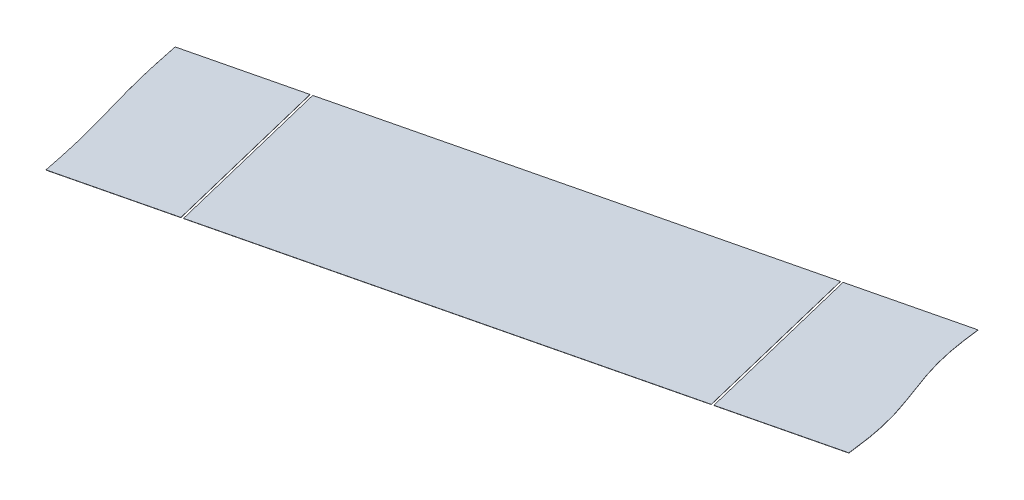
ISO-10303-21;
HEADER;
FILE_DESCRIPTION(('STEP AP214'),'2;1');
FILE_NAME('part.step','',(''),(''),'','','');
FILE_SCHEMA(('AUTOMOTIVE_DESIGN { 1 0 10303 214 1 1 1 1 }'));
ENDSEC;
DATA;
#1=APPLICATION_CONTEXT('core data for automotive mechanical design processes');
#2=APPLICATION_PROTOCOL_DEFINITION('international standard','automotive_design',2000,#1);
#3=PRODUCT_CONTEXT('',#1,'mechanical');
#4=PRODUCT('Part','Part','',(#3));
#5=PRODUCT_RELATED_PRODUCT_CATEGORY('part','',(#4));
#6=PRODUCT_DEFINITION_FORMATION('','',#4);
#7=PRODUCT_DEFINITION_CONTEXT('part definition',#1,'design');
#8=PRODUCT_DEFINITION('design','',#6,#7);
#9=PRODUCT_DEFINITION_SHAPE('','',#8);
#10=(LENGTH_UNIT() NAMED_UNIT(*) SI_UNIT(.MILLI.,.METRE.));
#11=(NAMED_UNIT(*) PLANE_ANGLE_UNIT() SI_UNIT($,.RADIAN.));
#12=(NAMED_UNIT(*) SI_UNIT($,.STERADIAN.) SOLID_ANGLE_UNIT());
#13=UNCERTAINTY_MEASURE_WITH_UNIT(LENGTH_MEASURE(1.E-05),#10,'distance_accuracy_value','');
#14=(GEOMETRIC_REPRESENTATION_CONTEXT(3) GLOBAL_UNCERTAINTY_ASSIGNED_CONTEXT((#13)) GLOBAL_UNIT_ASSIGNED_CONTEXT((#10,
#11,#12)) REPRESENTATION_CONTEXT('',''));
#15=CARTESIAN_POINT('',(0.,0.,0.));
#16=DIRECTION('',(0.,0.,1.));
#17=DIRECTION('',(1.,0.,0.));
#18=AXIS2_PLACEMENT_3D('',#15,#16,#17);
#19=CARTESIAN_POINT('',(2395.27818483003,381.38489247794,252.447974601586));
#20=DIRECTION('',(0.235073047336167,-0.00396825396826431,0.971969606199974));
#21=DIRECTION('',(0.971977259112275,0.,-0.235074898210314));
#22=AXIS2_PLACEMENT_3D('',#19,#20,#21);
#23=PLANE('',#22);
#24=DIRECTION('',(0.000932836897662165,0.999992126449225,0.00385705261553395));
#25=VECTOR('',#24,1.);
#26=CARTESIAN_POINT('',(2345.08494572677,371.384971213448,264.546496375752));
#27=LINE('',#26,#25);
#28=CARTESIAN_POINT('',(2345.09418081205,381.284893265295,264.584681196645));
#29=VERTEX_POINT('',#28);
#30=CARTESIAN_POINT('',(2345.09427409574,381.38489247794,264.585066901907));
#31=VERTEX_POINT('',#30);
#32=EDGE_CURVE('E122',#29,#31,#27,.T.);
#33=ORIENTED_EDGE('',*,*,#32,.T.);
#34=DIRECTION('',(-0.971977259112275,0.,0.235074898210314));
#35=VECTOR('',#34,1.);
#36=CARTESIAN_POINT('',(2395.27818483003,381.38489247794,252.447974601586));
#37=LINE('',#36,#35);
#38=CARTESIAN_POINT('',(2152.64277679151,381.38489247794,311.129896747549));
#39=VERTEX_POINT('',#38);
#40=EDGE_CURVE('E58',#31,#39,#37,.T.);
#41=ORIENTED_EDGE('',*,*,#40,.T.);
#42=DIRECTION('',(0.000932836897662165,0.999992126449225,0.00385705261553395));
#43=VECTOR('',#42,1.);
#44=CARTESIAN_POINT('',(2152.63344842254,371.384971213448,311.091326221394));
#45=LINE('',#44,#43);
#46=CARTESIAN_POINT('',(2152.64268350782,381.284893265295,311.129511042288));
#47=VERTEX_POINT('',#46);
#48=EDGE_CURVE('E117',#47,#39,#45,.T.);
#49=ORIENTED_EDGE('',*,*,#48,.F.);
#50=DIRECTION('',(-0.971977259112275,0.,0.235074898210314));
#51=VECTOR('',#50,1.);
#52=CARTESIAN_POINT('',(2395.27809154634,381.284893265295,252.447588896325));
#53=LINE('',#52,#51);
#54=EDGE_CURVE('E87',#29,#47,#53,.T.);
#55=ORIENTED_EDGE('',*,*,#54,.F.);
#56=EDGE_LOOP('',(#33,#41,#49,#55));
#57=FACE_BOUND('',#56,.T.);
#58=ADVANCED_FACE('F55',(#57),#23,.T.);
#59=CARTESIAN_POINT('',(2376.60605366932,381.699900005905,175.293985663563));
#60=DIRECTION('',(0.235073047336167,-0.00396825396826431,0.971969606199973));
#61=DIRECTION('',(0.971977259112275,0.,-0.235074898210314));
#62=AXIS2_PLACEMENT_3D('',#59,#60,#61);
#63=PLANE('',#62);
#64=DIRECTION('',(-0.971977259112275,0.,0.235074898210314));
#65=VECTOR('',#64,1.);
#66=CARTESIAN_POINT('',(2376.60605366932,381.699900005905,175.293985663563));
#67=LINE('',#66,#65);
#68=CARTESIAN_POINT('',(2326.4337296536,381.699900005905,187.428275689794));
#69=VERTEX_POINT('',#68);
#70=CARTESIAN_POINT('',(2133.98223234937,381.699900005905,233.973105535437));
#71=VERTEX_POINT('',#70);
#72=EDGE_CURVE('E114',#69,#71,#67,.T.);
#73=ORIENTED_EDGE('',*,*,#72,.F.);
#74=DIRECTION('',(0.000932836897662165,0.999992126449225,0.00385705261553395));
#75=VECTOR('',#74,1.);
#76=CARTESIAN_POINT('',(2326.42440128462,371.699978741413,187.389705163639));
#77=LINE('',#76,#75);
#78=CARTESIAN_POINT('',(2326.43363636991,381.59990079326,187.427889984532));
#79=VERTEX_POINT('',#78);
#80=EDGE_CURVE('E64',#79,#69,#77,.T.);
#81=ORIENTED_EDGE('',*,*,#80,.F.);
#82=DIRECTION('',(-0.971977259112275,0.,0.235074898210314));
#83=VECTOR('',#82,1.);
#84=CARTESIAN_POINT('',(2376.60596038563,381.59990079326,175.293599958301));
#85=LINE('',#84,#83);
#86=CARTESIAN_POINT('',(2133.98213906568,381.59990079326,233.972719830176));
#87=VERTEX_POINT('',#86);
#88=EDGE_CURVE('E103',#79,#87,#85,.T.);
#89=ORIENTED_EDGE('',*,*,#88,.T.);
#90=DIRECTION('',(0.000932836897662165,0.999992126449225,0.00385705261553395));
#91=VECTOR('',#90,1.);
#92=CARTESIAN_POINT('',(2133.97290398039,371.699978741413,233.934535009282));
#93=LINE('',#92,#91);
#94=EDGE_CURVE('E107',#87,#71,#93,.T.);
#95=ORIENTED_EDGE('',*,*,#94,.T.);
#96=EDGE_LOOP('',(#73,#81,#89,#95));
#97=FACE_BOUND('',#96,.T.);
#98=ADVANCED_FACE('F106',(#97),#63,.F.);
#99=CARTESIAN_POINT('',(4596.43898357471,393.653775003779,-3460.77851322098));
#100=DIRECTION('',(0.000932836897662165,0.999992126449225,0.00385705261553395));
#101=DIRECTION('',(0.,-0.00385705429370909,0.999992561538422));
#102=AXIS2_PLACEMENT_3D('',#99,#100,#101);
#103=PLANE('',#102);
#104=DIRECTION('',(0.235073047336166,-0.0039682539682627,0.971969606199974));
#105=VECTOR('',#104,1.);
#106=CARTESIAN_POINT('',(2345.09427409574,381.38489247794,264.585066901907));
#107=LINE('',#106,#105);
#108=EDGE_CURVE('E14',#69,#31,#107,.T.);
#109=ORIENTED_EDGE('',*,*,#108,.F.);
#110=ORIENTED_EDGE('',*,*,#72,.T.);
#111=DIRECTION('',(-0.235073047336166,0.0039682539682634,-0.971969606199974));
#112=VECTOR('',#111,1.);
#113=CARTESIAN_POINT('',(2152.64277679151,381.38489247794,311.129896747549));
#114=LINE('',#113,#112);
#115=EDGE_CURVE('E113',#39,#71,#114,.T.);
#116=ORIENTED_EDGE('',*,*,#115,.F.);
#117=ORIENTED_EDGE('',*,*,#40,.F.);
#118=EDGE_LOOP('',(#109,#110,#116,#117));
#119=FACE_BOUND('',#118,.T.);
#120=ADVANCED_FACE('F128',(#119),#103,.T.);
#121=CARTESIAN_POINT('',(4596.43889029102,393.553775791134,-3460.77889892624));
#122=DIRECTION('',(0.000932836897662165,0.999992126449225,0.00385705261553395));
#123=DIRECTION('',(0.,-0.00385705429370909,0.999992561538422));
#124=AXIS2_PLACEMENT_3D('',#121,#122,#123);
#125=PLANE('',#124);
#126=ORIENTED_EDGE('',*,*,#88,.F.);
#127=DIRECTION('',(0.235073047336166,-0.00396825396826328,0.971969606199974));
#128=VECTOR('',#127,1.);
#129=CARTESIAN_POINT('',(1618.30511291864,393.553775791134,-2740.51050991896));
#130=LINE('',#129,#128);
#131=EDGE_CURVE('E73',#79,#29,#130,.T.);
#132=ORIENTED_EDGE('',*,*,#131,.T.);
#133=ORIENTED_EDGE('',*,*,#54,.T.);
#134=DIRECTION('',(-0.235073047336166,0.00396825396826328,-0.971969606199974));
#135=VECTOR('',#134,1.);
#136=CARTESIAN_POINT('',(1425.85361561441,393.553775791134,-2693.96568007332));
#137=LINE('',#136,#135);
#138=EDGE_CURVE('E111',#47,#87,#137,.T.);
#139=ORIENTED_EDGE('',*,*,#138,.T.);
#140=EDGE_LOOP('',(#126,#132,#133,#139));
#141=FACE_BOUND('',#140,.T.);
#142=ADVANCED_FACE('F116',(#141),#125,.F.);
#143=CARTESIAN_POINT('',(2152.63344842254,371.384971213448,311.091326221394));
#144=DIRECTION('',(0.971977259112275,0.,-0.235074898210313));
#145=DIRECTION('',(-0.235074898210313,0.,-0.971977259112275));
#146=AXIS2_PLACEMENT_3D('',#143,#144,#145);
#147=PLANE('',#146);
#148=ORIENTED_EDGE('',*,*,#48,.T.);
#149=ORIENTED_EDGE('',*,*,#115,.T.);
#150=ORIENTED_EDGE('',*,*,#94,.F.);
#151=ORIENTED_EDGE('',*,*,#138,.F.);
#152=EDGE_LOOP('',(#148,#149,#150,#151));
#153=FACE_BOUND('',#152,.T.);
#154=ADVANCED_FACE('F110',(#153),#147,.F.);
#155=CARTESIAN_POINT('',(2345.08494572677,371.384971213448,264.546496375752));
#156=DIRECTION('',(-0.971977259112275,0.,0.235074898210313));
#157=DIRECTION('',(0.235074898210313,0.,0.971977259112275));
#158=AXIS2_PLACEMENT_3D('',#155,#156,#157);
#159=PLANE('',#158);
#160=ORIENTED_EDGE('',*,*,#80,.T.);
#161=ORIENTED_EDGE('',*,*,#108,.T.);
#162=ORIENTED_EDGE('',*,*,#32,.F.);
#163=ORIENTED_EDGE('',*,*,#131,.F.);
#164=EDGE_LOOP('',(#160,#161,#162,#163));
#165=FACE_BOUND('',#164,.T.);
#166=ADVANCED_FACE('F129',(#165),#159,.F.);
#167=CLOSED_SHELL('',(#58,#98,#120,#142,#154,#166));
#168=MANIFOLD_SOLID_BREP('B2',#167);
#169=CARTESIAN_POINT('',(2395.27818483003,381.38489247794,252.447974601588));
#170=CARTESIAN_POINT('',(2395.23043806307,381.386475828937,252.049017486661));
#171=CARTESIAN_POINT('',(2395.20393658994,381.387353474253,251.82788572132));
#172=CARTESIAN_POINT('',(2395.1628766104,381.388713251445,251.485275870303));
#173=CARTESIAN_POINT('',(2395.04691486838,381.392539552048,250.521302221176));
#174=CARTESIAN_POINT('',(2394.97939194031,381.394736463189,249.968054397501));
#175=CARTESIAN_POINT('',(2394.89889819591,381.397355389959,249.308530437594));
#176=CARTESIAN_POINT('',(2394.74563612036,381.402230432094,248.081677784998));
#177=CARTESIAN_POINT('',(2394.5869958183,381.407125548774,246.850921276371));
#178=CARTESIAN_POINT('',(2394.42203773334,381.412029851866,245.619311038399));
#179=CARTESIAN_POINT('',(2394.249679362,381.416939111286,244.3882055827));
#180=CARTESIAN_POINT('',(2394.06884033133,381.421851335165,243.15838261807));
#181=CARTESIAN_POINT('',(2393.87849290869,381.426765460672,241.930366257451));
#182=CARTESIAN_POINT('',(2393.67768678359,381.431680869076,240.704546749305));
#183=CARTESIAN_POINT('',(2393.3567261223,381.439119704293,238.853554965963));
#184=CARTESIAN_POINT('',(2392.88427536881,381.448926602792,236.425249541687));
#185=CARTESIAN_POINT('',(2392.35812533769,381.45873768294,234.008847260779));
#186=CARTESIAN_POINT('',(2391.77629424682,381.46854999921,231.605591089257));
#187=CARTESIAN_POINT('',(2391.13895372857,381.478361027339,229.216093965902));
#188=CARTESIAN_POINT('',(2390.44847923605,381.488167802758,226.840549985927));
#189=CARTESIAN_POINT('',(2389.8873545186,381.495607209398,225.047494273707));
#190=CARTESIAN_POINT('',(2389.50536417124,381.500522573771,223.865505994966));
#191=CARTESIAN_POINT('',(2389.11310601985,381.50543663671,222.686338422213));
#192=CARTESIAN_POINT('',(2388.71160877714,381.51034876524,221.509906865832));
#193=CARTESIAN_POINT('',(2388.30203165184,381.51525787297,220.336212629867));
#194=CARTESIAN_POINT('',(2387.88569899485,381.52016191177,219.165466421711));
#195=CARTESIAN_POINT('',(2387.46421042761,381.525056499953,217.99841738028));
#196=CARTESIAN_POINT('',(2387.03983997006,381.529930269629,216.83746280521));
#197=CARTESIAN_POINT('',(2386.80972366495,381.532552256674,216.21333198286));
#198=CARTESIAN_POINT('',(2386.6175821275,381.534741552308,215.692197873267));
#199=CARTESIAN_POINT('',(2386.28015153993,381.538568084275,214.781726980864));
#200=CARTESIAN_POINT('',(2386.15944954054,381.539935245611,214.456464295289));
#201=CARTESIAN_POINT('',(2386.08703290556,381.540755490709,214.261318984586));
#202=CARTESIAN_POINT('',(2385.79722945633,381.544036722958,213.480705556626));
#203=CARTESIAN_POINT('',(2385.72478895881,381.544857238235,213.285495969862));
#204=CARTESIAN_POINT('',(2385.60412036883,381.546224020972,212.960323360767));
#205=CARTESIAN_POINT('',(2385.26668995383,381.550050550034,212.049853180061));
#206=CARTESIAN_POINT('',(2385.0745148344,381.552240227172,211.528628282291));
#207=CARTESIAN_POINT('',(2384.84443314799,381.554861818406,210.904591706526));
#208=CARTESIAN_POINT('',(2384.42006203296,381.559735591872,209.743636307694));
#209=CARTESIAN_POINT('',(2383.9985729136,381.564630181551,208.576587011984));
#210=CARTESIAN_POINT('',(2383.58224000227,381.569534217143,207.405841697191));
#211=CARTESIAN_POINT('',(2383.17266242661,381.574443322779,206.232148112981));
#212=CARTESIAN_POINT('',(2382.77116432678,381.579355453027,205.055716318414));
#213=CARTESIAN_POINT('',(2382.3789052935,381.584269517127,203.876548657961));
#214=CARTESIAN_POINT('',(2381.99691419463,381.589184880004,202.694560948861));
#215=CARTESIAN_POINT('',(2381.43578795381,381.596624288075,200.901505234153));
#216=CARTESIAN_POINT('',(2380.74531136506,381.606431063908,198.525961653805));
#217=CARTESIAN_POINT('',(2380.10796866581,381.616242091816,196.136465115202));
#218=CARTESIAN_POINT('',(2379.81411411264,381.621197795887,194.922702393091));
#219=CARTESIAN_POINT('',(2379.52089247303,381.626147649874,193.710303311167));
#220=CARTESIAN_POINT('',(2378.99588934764,381.635946366146,191.296829147841));
#221=CARTESIAN_POINT('',(2378.52442497964,381.645740893277,188.871492605338));
#222=CARTESIAN_POINT('',(2378.2040869677,381.653170442814,187.022757668745));
#223=CARTESIAN_POINT('',(2378.0036577206,381.658079629618,185.79846004422));
#224=CARTESIAN_POINT('',(2377.81365091551,381.662987535936,184.571973711802));
#225=CARTESIAN_POINT('',(2377.63311898325,381.667893542798,183.343688318938));
#226=CARTESIAN_POINT('',(2377.46103742198,381.67279658841,182.114126928401));
#227=CARTESIAN_POINT('',(2377.29632947513,381.677694685572,180.884065163846));
#228=CARTESIAN_POINT('',(2377.13791675004,381.68258360714,179.65485978006));
#229=CARTESIAN_POINT('',(2376.9848636719,381.687452483481,178.429555145257));
#230=CARTESIAN_POINT('',(2376.90446338324,381.690068487862,177.770766250962));
#231=CARTESIAN_POINT('',(2376.83704057706,381.692262240636,177.218313061163));
#232=CARTESIAN_POINT('',(2376.72122704763,381.696083694176,176.255560231993));
#233=CARTESIAN_POINT('',(2376.68020779427,381.697442126394,175.913289233635));
#234=CARTESIAN_POINT('',(2376.65374609152,381.698318457059,175.692488690592));
#235=CARTESIAN_POINT('',(2376.60605366931,381.699900005905,175.293985663564));
#236=B_SPLINE_CURVE_WITH_KNOTS('',2,(#169,#170,#171,#172,#173,#174,#175,#176,#177,#178,#179,
#180,#181,#182,#183,#184,#185,#186,#187,#188,#189,#190,#191,#192,#193,#194,#195,#196,#197,#198,
#199,#200,#201,#202,#203,#204,#205,#206,#207,#208,#209,#210,#211,#212,#213,#214,#215,#216,#217,
#218,#219,#220,#221,#222,#223,#224,#225,#226,#227,#228,#229,#230,#231,#232,#233,#234,#235),
.UNSPECIFIED.,.F.,.F.,(3,2,1,2,1,1,1,1,1,1,1,1,1,1,1,1,1,1,1,1,1,1,1,1,1,2,1,2,1,2,1,2,1,1,1,1,
1,1,1,1,1,1,1,1,1,1,1,1,1,1,1,1,1,1,2,1,2,3),(0.,0.0078125,0.015625,0.03125,0.046875,0.0625,
0.078125,0.09375,0.109375,0.125,0.140625,0.15625,0.1875,0.21875,0.25,0.28125,0.3125,0.34375,
0.359375,0.375,0.390625,0.40625,0.421875,0.4375,0.453125,0.46875,0.484375,0.4921875,0.5,
0.5078125,0.515625,0.53125,0.546875,0.5625,0.578125,0.59375,0.609375,0.625,0.640625,0.65625,
0.6875,0.71875,0.75,0.750316619873047,0.781527042388916,0.812737464904785,0.843947887420654,
0.859553098678589,0.875158309936523,0.890763521194458,0.906368732452393,0.921973943710327,
0.937579154968262,0.953184366226196,0.968789577484131,0.984394788742065,0.992197394371033,1.),.UNSPECIFIED.);
#237=DIRECTION('',(-0.000932836897660746,-0.999992126449225,-0.00385705261553536));
#238=VECTOR('',#237,1.);
#239=SURFACE_OF_LINEAR_EXTRUSION('',#236,#238);
#240=CARTESIAN_POINT('',(2395.27809154634,381.284893265295,252.447588896326));
#241=CARTESIAN_POINT('',(2395.23034477938,381.286476616292,252.0486317814));
#242=CARTESIAN_POINT('',(2395.20384330625,381.287354261608,251.827500016058));
#243=CARTESIAN_POINT('',(2395.16278332671,381.2887140388,251.484890165041));
#244=CARTESIAN_POINT('',(2395.04682158469,381.292540339403,250.520916515914));
#245=CARTESIAN_POINT('',(2394.97929865662,381.294737250544,249.96766869224));
#246=CARTESIAN_POINT('',(2394.89880491222,381.297356177314,249.308144732332));
#247=CARTESIAN_POINT('',(2394.74554283667,381.302231219449,248.081292079736));
#248=CARTESIAN_POINT('',(2394.58690253462,381.307126336129,246.85053557111));
#249=CARTESIAN_POINT('',(2394.42194444965,381.312030639222,245.618925333138));
#250=CARTESIAN_POINT('',(2394.24958607831,381.316939898641,244.387819877438));
#251=CARTESIAN_POINT('',(2394.06874704764,381.321852122521,243.157996912808));
#252=CARTESIAN_POINT('',(2393.878399625,381.326766248027,241.929980552189));
#253=CARTESIAN_POINT('',(2393.6775934999,381.331681656432,240.704161044043));
#254=CARTESIAN_POINT('',(2393.35663283861,381.339120491648,238.853169260701));
#255=CARTESIAN_POINT('',(2392.88418208512,381.348927390147,236.424863836426));
#256=CARTESIAN_POINT('',(2392.358032054,381.358738470295,234.008461555518));
#257=CARTESIAN_POINT('',(2391.77620096313,381.368550786565,231.605205383995));
#258=CARTESIAN_POINT('',(2391.13886044488,381.378361814694,229.21570826064));
#259=CARTESIAN_POINT('',(2390.44838595236,381.388168590113,226.840164280665));
#260=CARTESIAN_POINT('',(2389.88726123491,381.395607996753,225.047108568445));
#261=CARTESIAN_POINT('',(2389.50527088755,381.400523361127,223.865120289704));
#262=CARTESIAN_POINT('',(2389.11301273616,381.405437424065,222.685952716952));
#263=CARTESIAN_POINT('',(2388.71151549345,381.410349552595,221.50952116057));
#264=CARTESIAN_POINT('',(2388.30193836815,381.415258660325,220.335826924605));
#265=CARTESIAN_POINT('',(2387.88560571116,381.420162699125,219.16508071645));
#266=CARTESIAN_POINT('',(2387.46411714392,381.425057287308,217.998031675018));
#267=CARTESIAN_POINT('',(2387.03974668637,381.429931056984,216.837077099948));
#268=CARTESIAN_POINT('',(2386.80963038126,381.432553044029,216.212946277598));
#269=CARTESIAN_POINT('',(2386.61748884381,381.434742339663,215.691812168005));
#270=CARTESIAN_POINT('',(2386.28005825624,381.43856887163,214.781341275603));
#271=CARTESIAN_POINT('',(2386.15935625685,381.439936032966,214.456078590027));
#272=CARTESIAN_POINT('',(2386.08693962187,381.440756278064,214.260933279324));
#273=CARTESIAN_POINT('',(2385.79713617264,381.444037510314,213.480319851364));
#274=CARTESIAN_POINT('',(2385.72469567512,381.44485802559,213.285110264601));
#275=CARTESIAN_POINT('',(2385.60402708514,381.446224808327,212.959937655505));
#276=CARTESIAN_POINT('',(2385.26659667015,381.450051337389,212.0494674748));
#277=CARTESIAN_POINT('',(2385.07442155071,381.452241014527,211.528242577029));
#278=CARTESIAN_POINT('',(2384.8443398643,381.454862605761,210.904206001264));
#279=CARTESIAN_POINT('',(2384.41996874927,381.459736379227,209.743250602433));
#280=CARTESIAN_POINT('',(2383.99847962991,381.464630968906,208.576201306723));
#281=CARTESIAN_POINT('',(2383.58214671858,381.469535004498,207.405455991929));
#282=CARTESIAN_POINT('',(2383.17256914292,381.474444110134,206.23176240772));
#283=CARTESIAN_POINT('',(2382.77107104309,381.479356240382,205.055330613153));
#284=CARTESIAN_POINT('',(2382.37881200981,381.484270304482,203.876162952699));
#285=CARTESIAN_POINT('',(2381.99682091094,381.48918566736,202.694175243599));
#286=CARTESIAN_POINT('',(2381.43569467012,381.49662507543,200.901119528892));
#287=CARTESIAN_POINT('',(2380.74521808137,381.506431851263,198.525575948543));
#288=CARTESIAN_POINT('',(2380.10787538212,381.516242879171,196.136079409941));
#289=CARTESIAN_POINT('',(2379.81402082895,381.521198583242,194.922316687829));
#290=CARTESIAN_POINT('',(2379.52079918934,381.526148437229,193.709917605905));
#291=CARTESIAN_POINT('',(2378.99579606395,381.535947153501,191.296443442579));
#292=CARTESIAN_POINT('',(2378.52433169595,381.545741680632,188.871106900077));
#293=CARTESIAN_POINT('',(2378.20399368401,381.553171230169,187.022371963484));
#294=CARTESIAN_POINT('',(2378.00356443691,381.558080416973,185.798074338959));
#295=CARTESIAN_POINT('',(2377.81355763182,381.562988323291,184.57158800654));
#296=CARTESIAN_POINT('',(2377.63302569956,381.567894330153,183.343302613676));
#297=CARTESIAN_POINT('',(2377.46094413829,381.572797375765,182.113741223139));
#298=CARTESIAN_POINT('',(2377.29623619145,381.577695472927,180.883679458584));
#299=CARTESIAN_POINT('',(2377.13782346635,381.582584394495,179.654474074798));
#300=CARTESIAN_POINT('',(2376.98477038821,381.587453270836,178.429169439996));
#301=CARTESIAN_POINT('',(2376.90437009955,381.590069275217,177.770380545701));
#302=CARTESIAN_POINT('',(2376.83694729337,381.592263027991,177.217927355901));
#303=CARTESIAN_POINT('',(2376.72113376394,381.596084481531,176.255174526731));
#304=CARTESIAN_POINT('',(2376.68011451058,381.597442913749,175.912903528373));
#305=CARTESIAN_POINT('',(2376.65365280783,381.598319244414,175.69210298533));
#306=CARTESIAN_POINT('',(2376.60596038562,381.59990079326,175.293599958302));
#307=B_SPLINE_CURVE_WITH_KNOTS('',2,(#240,#241,#242,#243,#244,#245,#246,#247,#248,#249,#250,
#251,#252,#253,#254,#255,#256,#257,#258,#259,#260,#261,#262,#263,#264,#265,#266,#267,#268,#269,
#270,#271,#272,#273,#274,#275,#276,#277,#278,#279,#280,#281,#282,#283,#284,#285,#286,#287,#288,
#289,#290,#291,#292,#293,#294,#295,#296,#297,#298,#299,#300,#301,#302,#303,#304,#305,#306),
.UNSPECIFIED.,.F.,.F.,(3,2,1,2,1,1,1,1,1,1,1,1,1,1,1,1,1,1,1,1,1,1,1,1,1,2,1,2,1,2,1,2,1,1,1,1,
1,1,1,1,1,1,1,1,1,1,1,1,1,1,1,1,1,1,2,1,2,3),(0.,0.0078125,0.015625,0.03125,0.046875,0.0625,
0.078125,0.09375,0.109375,0.125,0.140625,0.15625,0.1875,0.21875,0.25,0.28125,0.3125,0.34375,
0.359375,0.375,0.390625,0.40625,0.421875,0.4375,0.453125,0.46875,0.484375,0.4921875,0.5,
0.5078125,0.515625,0.53125,0.546875,0.5625,0.578125,0.59375,0.609375,0.625,0.640625,0.65625,
0.6875,0.71875,0.75,0.750316619873047,0.781527042388916,0.812737464904785,0.843947887420654,
0.859553098678589,0.875158309936523,0.890763521194458,0.906368732452393,0.921973943710327,
0.937579154968262,0.953184366226196,0.968789577484131,0.984394788742065,0.992197394371033,1.),.UNSPECIFIED.);
#308=CARTESIAN_POINT('',(2395.27809154634,381.284893265295,252.447588896325));
#309=VERTEX_POINT('',#308);
#310=CARTESIAN_POINT('',(2376.60596038562,381.59990079326,175.293599958302));
#311=VERTEX_POINT('',#310);
#312=EDGE_CURVE('E253',#309,#311,#307,.T.);
#313=ORIENTED_EDGE('',*,*,#312,.T.);
#314=DIRECTION('',(-0.000932836897660746,-0.999992126449225,-0.00385705261553536));
#315=VECTOR('',#314,1.);
#316=CARTESIAN_POINT('',(2376.60605366931,381.699900005905,175.293985663563));
#317=LINE('',#316,#315);
#318=CARTESIAN_POINT('',(2376.60605366931,381.699900005905,175.293985663563));
#319=VERTEX_POINT('',#318);
#320=EDGE_CURVE('E247',#319,#311,#317,.T.);
#321=ORIENTED_EDGE('',*,*,#320,.F.);
#322=CARTESIAN_POINT('',(2395.27818483003,381.38489247794,252.447974601587));
#323=VERTEX_POINT('',#322);
#324=EDGE_CURVE('E256',#323,#319,#236,.T.);
#325=ORIENTED_EDGE('',*,*,#324,.F.);
#326=DIRECTION('',(-0.000932836897660746,-0.999992126449225,-0.00385705261553536));
#327=VECTOR('',#326,1.);
#328=CARTESIAN_POINT('',(2395.27818483003,381.38489247794,252.447974601587));
#329=LINE('',#328,#327);
#330=EDGE_CURVE('E198',#323,#309,#329,.T.);
#331=ORIENTED_EDGE('',*,*,#330,.T.);
#332=EDGE_LOOP('',(#313,#321,#325,#331));
#333=FACE_BOUND('',#332,.T.);
#334=ADVANCED_FACE('F190',(#333),#239,.F.);
#335=CARTESIAN_POINT('',(4596.43898357471,393.653775003779,-3460.77851322098));
#336=DIRECTION('',(0.000932836897662165,0.999992126449225,0.00385705261553395));
#337=DIRECTION('',(0.,-0.00385705429370909,0.999992561538422));
#338=AXIS2_PLACEMENT_3D('',#335,#336,#337);
#339=PLANE('',#338);
#340=DIRECTION('',(-0.235073047336171,0.00396825396826269,-0.971969606199972));
#341=VECTOR('',#340,1.);
#342=CARTESIAN_POINT('',(2327.40570691271,381.699900005905,187.193200791584));
#343=LINE('',#342,#341);
#344=CARTESIAN_POINT('',(2346.06625135486,381.38489247794,264.349992003697));
#345=VERTEX_POINT('',#344);
#346=CARTESIAN_POINT('',(2327.40570691271,381.699900005905,187.193200791584));
#347=VERTEX_POINT('',#346);
#348=EDGE_CURVE('E233',#345,#347,#343,.T.);
#349=ORIENTED_EDGE('',*,*,#348,.F.);
#350=DIRECTION('',(-0.971977259112275,0.,0.235074898210314));
#351=VECTOR('',#350,1.);
#352=CARTESIAN_POINT('',(2395.27818483003,381.38489247794,252.447974601586));
#353=LINE('',#352,#351);
#354=EDGE_CURVE('E240',#323,#345,#353,.T.);
#355=ORIENTED_EDGE('',*,*,#354,.F.);
#356=ORIENTED_EDGE('',*,*,#324,.T.);
#357=DIRECTION('',(-0.971977259112275,0.,0.235074898210314));
#358=VECTOR('',#357,1.);
#359=CARTESIAN_POINT('',(2376.60605366932,381.699900005905,175.293985663563));
#360=LINE('',#359,#358);
#361=EDGE_CURVE('E242',#319,#347,#360,.T.);
#362=ORIENTED_EDGE('',*,*,#361,.T.);
#363=EDGE_LOOP('',(#349,#355,#356,#362));
#364=FACE_BOUND('',#363,.T.);
#365=ADVANCED_FACE('F239',(#364),#339,.T.);
#366=CARTESIAN_POINT('',(4596.43889029102,393.553775791134,-3460.77889892624));
#367=DIRECTION('',(0.000932836897662165,0.999992126449225,0.00385705261553395));
#368=DIRECTION('',(0.,-0.00385705429370909,0.999992561538422));
#369=AXIS2_PLACEMENT_3D('',#366,#367,#368);
#370=PLANE('',#369);
#371=DIRECTION('',(-0.971977259112275,0.,0.235074898210314));
#372=VECTOR('',#371,1.);
#373=CARTESIAN_POINT('',(2395.27809154634,381.284893265295,252.447588896325));
#374=LINE('',#373,#372);
#375=CARTESIAN_POINT('',(2346.06615807117,381.284893265295,264.349606298435));
#376=VERTEX_POINT('',#375);
#377=EDGE_CURVE('E252',#309,#376,#374,.T.);
#378=ORIENTED_EDGE('',*,*,#377,.T.);
#379=DIRECTION('',(-0.235073047336171,0.00396825396826328,-0.971969606199973));
#380=VECTOR('',#379,1.);
#381=CARTESIAN_POINT('',(1619.27709017774,393.553775791134,-2740.74558481716));
#382=LINE('',#381,#380);
#383=CARTESIAN_POINT('',(2327.40561362902,381.59990079326,187.192815086323));
#384=VERTEX_POINT('',#383);
#385=EDGE_CURVE('E53',#376,#384,#382,.T.);
#386=ORIENTED_EDGE('',*,*,#385,.T.);
#387=DIRECTION('',(-0.971977259112275,0.,0.235074898210314));
#388=VECTOR('',#387,1.);
#389=CARTESIAN_POINT('',(2376.60596038563,381.59990079326,175.293599958301));
#390=LINE('',#389,#388);
#391=EDGE_CURVE('E244',#311,#384,#390,.T.);
#392=ORIENTED_EDGE('',*,*,#391,.F.);
#393=ORIENTED_EDGE('',*,*,#312,.F.);
#394=EDGE_LOOP('',(#378,#386,#392,#393));
#395=FACE_BOUND('',#394,.T.);
#396=ADVANCED_FACE('F272',(#395),#370,.F.);
#397=CARTESIAN_POINT('',(2376.60605366932,381.699900005905,175.293985663563));
#398=DIRECTION('',(0.235073047336167,-0.00396825396826431,0.971969606199973));
#399=DIRECTION('',(0.971977259112275,0.,-0.235074898210314));
#400=AXIS2_PLACEMENT_3D('',#397,#398,#399);
#401=PLANE('',#400);
#402=ORIENTED_EDGE('',*,*,#391,.T.);
#403=DIRECTION('',(0.000932836897662165,0.999992126449225,0.00385705261553395));
#404=VECTOR('',#403,1.);
#405=CARTESIAN_POINT('',(2327.39637854373,371.699978741413,187.154630265429));
#406=LINE('',#405,#404);
#407=EDGE_CURVE('E205',#384,#347,#406,.T.);
#408=ORIENTED_EDGE('',*,*,#407,.T.);
#409=ORIENTED_EDGE('',*,*,#361,.F.);
#410=ORIENTED_EDGE('',*,*,#320,.T.);
#411=EDGE_LOOP('',(#402,#408,#409,#410));
#412=FACE_BOUND('',#411,.T.);
#413=ADVANCED_FACE('F275',(#412),#401,.F.);
#414=CARTESIAN_POINT('',(2395.27818483003,381.38489247794,252.447974601586));
#415=DIRECTION('',(0.235073047336167,-0.00396825396826431,0.971969606199974));
#416=DIRECTION('',(0.971977259112275,0.,-0.235074898210314));
#417=AXIS2_PLACEMENT_3D('',#414,#415,#416);
#418=PLANE('',#417);
#419=DIRECTION('',(0.000932836897662165,0.999992126449225,0.00385705261553395));
#420=VECTOR('',#419,1.);
#421=CARTESIAN_POINT('',(2346.05692298588,371.384971213448,264.311421477541));
#422=LINE('',#421,#420);
#423=EDGE_CURVE('E230',#376,#345,#422,.T.);
#424=ORIENTED_EDGE('',*,*,#423,.F.);
#425=ORIENTED_EDGE('',*,*,#377,.F.);
#426=ORIENTED_EDGE('',*,*,#330,.F.);
#427=ORIENTED_EDGE('',*,*,#354,.T.);
#428=EDGE_LOOP('',(#424,#425,#426,#427));
#429=FACE_BOUND('',#428,.T.);
#430=ADVANCED_FACE('F192',(#429),#418,.T.);
#431=CARTESIAN_POINT('',(2327.39637854373,371.699978741413,187.154630265429));
#432=DIRECTION('',(0.971977259112274,0.,-0.235074898210318));
#433=DIRECTION('',(-0.235074898210318,0.,-0.971977259112274));
#434=AXIS2_PLACEMENT_3D('',#431,#432,#433);
#435=PLANE('',#434);
#436=ORIENTED_EDGE('',*,*,#423,.T.);
#437=ORIENTED_EDGE('',*,*,#348,.T.);
#438=ORIENTED_EDGE('',*,*,#407,.F.);
#439=ORIENTED_EDGE('',*,*,#385,.F.);
#440=EDGE_LOOP('',(#436,#437,#438,#439));
#441=FACE_BOUND('',#440,.T.);
#442=ADVANCED_FACE('F232',(#441),#435,.F.);
#443=CLOSED_SHELL('',(#334,#365,#396,#413,#430,#442));
#444=MANIFOLD_SOLID_BREP('B8',#443);
#445=CARTESIAN_POINT('',(2083.80990833365,381.699900005905,246.107395561668));
#446=CARTESIAN_POINT('',(2083.96928072871,381.696680757214,246.903483974255));
#447=CARTESIAN_POINT('',(2084.0536629375,381.694978013281,247.324534929572));
#448=CARTESIAN_POINT('',(2084.18870901601,381.692252925917,247.998388828213));
#449=CARTESIAN_POINT('',(2084.29789550136,381.690056020656,248.541558701766));
#450=CARTESIAN_POINT('',(2084.42805649163,381.687437094299,249.189070418955));
#451=CARTESIAN_POINT('',(2084.67149304521,381.682562053809,250.394113743424));
#452=CARTESIAN_POINT('',(2085.05198799818,381.674991493271,252.264858563159));
#453=CARTESIAN_POINT('',(2085.28854029357,381.670368050158,253.406336898813));
#454=CARTESIAN_POINT('',(2085.55032974736,381.665251343745,254.669596633875));
#455=CARTESIAN_POINT('',(2086.06259919758,381.655470924884,257.081406618583));
#456=CARTESIAN_POINT('',(2086.59026303072,381.645672779719,259.494089216761));
#457=CARTESIAN_POINT('',(2087.13349844031,381.635891144138,261.898725464873));
#458=CARTESIAN_POINT('',(2087.69335529534,381.626129296767,264.2942114226));
#459=CARTESIAN_POINT('',(2087.9854748907,381.621198042888,265.502054711323));
#460=CARTESIAN_POINT('',(2088.2791296725,381.6162424863,266.715827511614));
#461=CARTESIAN_POINT('',(2088.87910995113,381.606431454516,269.114361241211));
#462=CARTESIAN_POINT('',(2089.49670322863,381.596624678433,271.507531879947));
#463=CARTESIAN_POINT('',(2090.13019063557,381.586826780464,273.894556718614));
#464=CARTESIAN_POINT('',(2090.77690619256,381.577046886372,276.273714555015));
#465=CARTESIAN_POINT('',(2091.12157106394,381.571928197669,277.517444617558));
#466=CARTESIAN_POINT('',(2091.43266977171,381.567308006948,278.640050509228));
#467=CARTESIAN_POINT('',(2091.94932298622,381.559735978082,280.478245828942));
#468=CARTESIAN_POINT('',(2092.28343322379,381.554862211311,281.661029289301));
#469=CARTESIAN_POINT('',(2092.46378448251,381.552240227172,282.297195147259));
#470=CARTESIAN_POINT('',(2092.61437284168,381.550050942261,282.828376206849));
#471=CARTESIAN_POINT('',(2092.80272215135,381.547318234547,283.491314275643));
#472=CARTESIAN_POINT('',(2092.91582852637,381.545677205631,283.889417788514));
#473=CARTESIAN_POINT('',(2093.36838819927,381.539115593909,285.481150209433));
#474=CARTESIAN_POINT('',(2093.481516348,381.537474249298,285.87933030429));
#475=CARTESIAN_POINT('',(2093.66983726183,381.534741953928,286.54216833507));
#476=CARTESIAN_POINT('',(2093.82045401683,381.532552256674,287.073449432675));
#477=CARTESIAN_POINT('',(2094.00077810953,381.529930668055,287.709519316736));
#478=CARTESIAN_POINT('',(2094.33488868985,381.525056897891,288.892303574066));
#479=CARTESIAN_POINT('',(2094.85154173466,381.517484874712,290.730497460294));
#480=CARTESIAN_POINT('',(2095.1626674354,381.512864286176,291.853199962375));
#481=CARTESIAN_POINT('',(2095.50730530613,381.50774600186,293.096831712693));
#482=CARTESIAN_POINT('',(2096.15402212465,381.497966096821,295.475992081962));
#483=CARTESIAN_POINT('',(2096.78751038974,381.488168195106,297.863017684247));
#484=CARTESIAN_POINT('',(2097.40510428026,381.478361420224,300.256187863584));
#485=CARTESIAN_POINT('',(2098.00508493676,381.468550394223,302.654720002141));
#486=CARTESIAN_POINT('',(2098.58654067498,381.458738079942,305.058066438016));
#487=CARTESIAN_POINT('',(2099.14931462961,381.448926999899,307.465611112892));
#488=CARTESIAN_POINT('',(2099.6939539394,381.439120098068,309.876458435529));
#489=CARTESIAN_POINT('',(2100.22161885949,381.429321944133,312.289143044665));
#490=CARTESIAN_POINT('',(2100.73388873737,381.419541527015,314.700952473873));
#491=CARTESIAN_POINT('',(2100.99569820578,381.414424433687,315.964307681119));
#492=CARTESIAN_POINT('',(2101.23223058731,381.409801383654,317.105688921895));
#493=CARTESIAN_POINT('',(2101.6127252561,381.402230833321,318.976431164459));
#494=CARTESIAN_POINT('',(2101.85616265902,381.397355778095,320.181478104041));
#495=CARTESIAN_POINT('',(2101.98634299798,381.394736463189,320.829085878166));
#496=CARTESIAN_POINT('',(2102.09551058251,381.392539938863,321.372161560602));
#497=CARTESIAN_POINT('',(2102.23057556185,381.389814470565,322.046109650361));
#498=CARTESIAN_POINT('',(2102.31494368076,381.388112011241,322.467090224722));
#499=CARTESIAN_POINT('',(2102.4743301657,381.38489247794,323.263249018265));
#500=B_SPLINE_CURVE_WITH_KNOTS('',2,(#445,#446,#447,#448,#449,#450,#451,#452,#453,#454,#455,
#456,#457,#458,#459,#460,#461,#462,#463,#464,#465,#466,#467,#468,#469,#470,#471,#472,#473,#474,
#475,#476,#477,#478,#479,#480,#481,#482,#483,#484,#485,#486,#487,#488,#489,#490,#491,#492,#493,
#494,#495,#496,#497,#498,#499),.UNSPECIFIED.,.F.,.F.,(3,2,2,1,1,2,1,1,1,1,1,1,1,1,1,1,2,1,1,2,2,
1,2,2,1,1,2,1,1,1,1,1,1,1,1,1,2,1,1,2,2,3),(0.,0.015625,0.03125,0.046875,0.0625,0.09375,0.125,
0.15625,0.1875,0.218592166900635,0.24968433380127,0.25,0.28125,0.3125,0.34375,0.375,0.40625,
0.4375,0.453125,0.46875,0.484375,0.5,0.515625,0.53125,0.546875,0.5625,0.59375,0.625,0.65625,
0.6875,0.71875,0.75,0.78125,0.8125,0.84375,0.875,0.90625,0.9375,0.953125,0.96875,0.984375,1.),.UNSPECIFIED.);
#501=DIRECTION('',(-0.000932836897660746,-0.999992126449225,-0.00385705261553536));
#502=VECTOR('',#501,1.);
#503=SURFACE_OF_LINEAR_EXTRUSION('',#500,#502);
#504=CARTESIAN_POINT('',(2083.80981504996,381.59990079326,246.107009856407));
#505=CARTESIAN_POINT('',(2083.96918744502,381.596681544569,246.903098268993));
#506=CARTESIAN_POINT('',(2084.05356965381,381.594978800636,247.324149224311));
#507=CARTESIAN_POINT('',(2084.18861573232,381.592253713272,247.998003122952));
#508=CARTESIAN_POINT('',(2084.29780221767,381.590056808011,248.541172996505));
#509=CARTESIAN_POINT('',(2084.42796320794,381.587437881654,249.188684713693));
#510=CARTESIAN_POINT('',(2084.67139976152,381.582562841165,250.393728038162));
#511=CARTESIAN_POINT('',(2085.05189471449,381.574992280626,252.264472857898));
#512=CARTESIAN_POINT('',(2085.28844700988,381.570368837514,253.405951193552));
#513=CARTESIAN_POINT('',(2085.55023646367,381.5652521311,254.669210928614));
#514=CARTESIAN_POINT('',(2086.06250591389,381.555471712239,257.081020913321));
#515=CARTESIAN_POINT('',(2086.59016974703,381.545673567074,259.4937035115));
#516=CARTESIAN_POINT('',(2087.13340515662,381.535891931493,261.898339759611));
#517=CARTESIAN_POINT('',(2087.69326201165,381.526130084122,264.293825717339));
#518=CARTESIAN_POINT('',(2087.98538160701,381.521198830243,265.501669006061));
#519=CARTESIAN_POINT('',(2088.27903638881,381.516243273655,266.715441806352));
#520=CARTESIAN_POINT('',(2088.87901666744,381.506432241871,269.113975535949));
#521=CARTESIAN_POINT('',(2089.49660994494,381.496625465788,271.507146174685));
#522=CARTESIAN_POINT('',(2090.13009735188,381.486827567819,273.894171013353));
#523=CARTESIAN_POINT('',(2090.77681290887,381.477047673727,276.273328849754));
#524=CARTESIAN_POINT('',(2091.12147778025,381.471928985025,277.517058912297));
#525=CARTESIAN_POINT('',(2091.43257648802,381.467308794303,278.639664803966));
#526=CARTESIAN_POINT('',(2091.94922970253,381.459736765437,280.477860123681));
#527=CARTESIAN_POINT('',(2092.2833399401,381.454862998666,281.66064358404));
#528=CARTESIAN_POINT('',(2092.46369119883,381.452241014527,282.296809441997));
#529=CARTESIAN_POINT('',(2092.61427955799,381.450051729616,282.827990501587));
#530=CARTESIAN_POINT('',(2092.80262886766,381.447319021902,283.490928570381));
#531=CARTESIAN_POINT('',(2092.91573524268,381.445677992986,283.889032083252));
#532=CARTESIAN_POINT('',(2093.36829491558,381.439116381264,285.480764504171));
#533=CARTESIAN_POINT('',(2093.48142306431,381.437475036653,285.878944599029));
#534=CARTESIAN_POINT('',(2093.66974397814,381.434742741283,286.541782629808));
#535=CARTESIAN_POINT('',(2093.82036073314,381.432553044029,287.073063727413));
#536=CARTESIAN_POINT('',(2094.00068482584,381.429931455411,287.709133611475));
#537=CARTESIAN_POINT('',(2094.33479540616,381.425057685246,288.891917868804));
#538=CARTESIAN_POINT('',(2094.85144845097,381.417485662067,290.730111755032));
#539=CARTESIAN_POINT('',(2095.16257415171,381.412865073531,291.852814257113));
#540=CARTESIAN_POINT('',(2095.50721202244,381.407746789215,293.096446007432));
#541=CARTESIAN_POINT('',(2096.15392884096,381.397966884176,295.4756063767));
#542=CARTESIAN_POINT('',(2096.78741710605,381.388168982461,297.862631978985));
#543=CARTESIAN_POINT('',(2097.40501099657,381.378362207579,300.255802158322));
#544=CARTESIAN_POINT('',(2098.00499165307,381.368551181579,302.654334296879));
#545=CARTESIAN_POINT('',(2098.58644739129,381.358738867297,305.057680732755));
#546=CARTESIAN_POINT('',(2099.14922134592,381.348927787254,307.465225407631));
#547=CARTESIAN_POINT('',(2099.69386065571,381.339120885423,309.876072730267));
#548=CARTESIAN_POINT('',(2100.2215255758,381.329322731488,312.288757339404));
#549=CARTESIAN_POINT('',(2100.73379545368,381.319542314371,314.700566768611));
#550=CARTESIAN_POINT('',(2100.99560492209,381.314425221042,315.963921975858));
#551=CARTESIAN_POINT('',(2101.23213730362,381.309802171009,317.105303216633));
#552=CARTESIAN_POINT('',(2101.61263197241,381.302231620676,318.976045459198));
#553=CARTESIAN_POINT('',(2101.85606937533,381.29735656545,320.181092398779));
#554=CARTESIAN_POINT('',(2101.98624971429,381.294737250544,320.828700172905));
#555=CARTESIAN_POINT('',(2102.09541729882,381.292540726218,321.37177585534));
#556=CARTESIAN_POINT('',(2102.23048227816,381.28981525792,322.045723945099));
#557=CARTESIAN_POINT('',(2102.31485039707,381.288112798596,322.46670451946));
#558=CARTESIAN_POINT('',(2102.47423688201,381.284893265295,323.262863313003));
#559=B_SPLINE_CURVE_WITH_KNOTS('',2,(#504,#505,#506,#507,#508,#509,#510,#511,#512,#513,#514,
#515,#516,#517,#518,#519,#520,#521,#522,#523,#524,#525,#526,#527,#528,#529,#530,#531,#532,#533,
#534,#535,#536,#537,#538,#539,#540,#541,#542,#543,#544,#545,#546,#547,#548,#549,#550,#551,#552,
#553,#554,#555,#556,#557,#558),.UNSPECIFIED.,.F.,.F.,(3,2,2,1,1,2,1,1,1,1,1,1,1,1,1,1,2,1,1,2,2,
1,2,2,1,1,2,1,1,1,1,1,1,1,1,1,2,1,1,2,2,3),(0.,0.015625,0.03125,0.046875,0.0625,0.09375,0.125,
0.15625,0.1875,0.218592166900635,0.24968433380127,0.25,0.28125,0.3125,0.34375,0.375,0.40625,
0.4375,0.453125,0.46875,0.484375,0.5,0.515625,0.53125,0.546875,0.5625,0.59375,0.625,0.65625,
0.6875,0.71875,0.75,0.78125,0.8125,0.84375,0.875,0.90625,0.9375,0.953125,0.96875,0.984375,1.),.UNSPECIFIED.);
#560=CARTESIAN_POINT('',(2083.80981504996,381.59990079326,246.107009856407));
#561=VERTEX_POINT('',#560);
#562=CARTESIAN_POINT('',(2102.47423688201,381.284893265295,323.262863313003));
#563=VERTEX_POINT('',#562);
#564=EDGE_CURVE('E367',#561,#563,#559,.T.);
#565=ORIENTED_EDGE('',*,*,#564,.T.);
#566=DIRECTION('',(-0.000932836897660746,-0.999992126449225,-0.00385705261553536));
#567=VECTOR('',#566,1.);
#568=CARTESIAN_POINT('',(2102.4743301657,381.38489247794,323.263249018265));
#569=LINE('',#568,#567);
#570=CARTESIAN_POINT('',(2102.4743301657,381.38489247794,323.263249018265));
#571=VERTEX_POINT('',#570);
#572=EDGE_CURVE('E371',#571,#563,#569,.T.);
#573=ORIENTED_EDGE('',*,*,#572,.F.);
#574=CARTESIAN_POINT('',(2083.80990833365,381.699900005905,246.107395561668));
#575=VERTEX_POINT('',#574);
#576=EDGE_CURVE('E374',#575,#571,#500,.T.);
#577=ORIENTED_EDGE('',*,*,#576,.F.);
#578=DIRECTION('',(-0.000932836897660746,-0.999992126449225,-0.00385705261553536));
#579=VECTOR('',#578,1.);
#580=CARTESIAN_POINT('',(2083.80990833365,381.699900005905,246.107395561668));
#581=LINE('',#580,#579);
#582=EDGE_CURVE('E335',#575,#561,#581,.T.);
#583=ORIENTED_EDGE('',*,*,#582,.T.);
#584=EDGE_LOOP('',(#565,#573,#577,#583));
#585=FACE_BOUND('',#584,.T.);
#586=ADVANCED_FACE('F327',(#585),#503,.F.);
#587=CARTESIAN_POINT('',(4596.43889029102,393.553775791134,-3460.77889892624));
#588=DIRECTION('',(0.000932836897662165,0.999992126449225,0.00385705261553395));
#589=DIRECTION('',(0.,-0.00385705429370909,0.999992561538422));
#590=AXIS2_PLACEMENT_3D('',#587,#588,#589);
#591=PLANE('',#590);
#592=DIRECTION('',(-0.971977259112275,0.,0.235074898210314));
#593=VECTOR('',#592,1.);
#594=CARTESIAN_POINT('',(2376.60596038563,381.59990079326,175.293599958301));
#595=LINE('',#594,#593);
#596=CARTESIAN_POINT('',(2133.01016180656,381.59990079326,234.207794728386));
#597=VERTEX_POINT('',#596);
#598=EDGE_CURVE('E368',#597,#561,#595,.T.);
#599=ORIENTED_EDGE('',*,*,#598,.F.);
#600=DIRECTION('',(0.235073047336172,-0.00396825396826328,0.971969606199973));
#601=VECTOR('',#600,1.);
#602=CARTESIAN_POINT('',(1424.88163835529,393.553775791134,-2693.73060517509));
#603=LINE('',#602,#601);
#604=CARTESIAN_POINT('',(2151.67070624871,381.284893265295,311.364585940498));
#605=VERTEX_POINT('',#604);
#606=EDGE_CURVE('E188',#597,#605,#603,.T.);
#607=ORIENTED_EDGE('',*,*,#606,.T.);
#608=DIRECTION('',(-0.971977259112275,0.,0.235074898210314));
#609=VECTOR('',#608,1.);
#610=CARTESIAN_POINT('',(2395.27809154634,381.284893265295,252.447588896325));
#611=LINE('',#610,#609);
#612=EDGE_CURVE('E363',#605,#563,#611,.T.);
#613=ORIENTED_EDGE('',*,*,#612,.T.);
#614=ORIENTED_EDGE('',*,*,#564,.F.);
#615=EDGE_LOOP('',(#599,#607,#613,#614));
#616=FACE_BOUND('',#615,.T.);
#617=ADVANCED_FACE('F365',(#616),#591,.F.);
#618=CARTESIAN_POINT('',(4596.43898357471,393.653775003779,-3460.77851322098));
#619=DIRECTION('',(0.000932836897662165,0.999992126449225,0.00385705261553395));
#620=DIRECTION('',(0.,-0.00385705429370909,0.999992561538422));
#621=AXIS2_PLACEMENT_3D('',#618,#619,#620);
#622=PLANE('',#621);
#623=DIRECTION('',(0.235073047336172,-0.00396825396826339,0.971969606199972));
#624=VECTOR('',#623,1.);
#625=CARTESIAN_POINT('',(2133.01025509025,381.699900005905,234.208180433647));
#626=LINE('',#625,#624);
#627=CARTESIAN_POINT('',(2133.01025509025,381.699900005905,234.208180433647));
#628=VERTEX_POINT('',#627);
#629=CARTESIAN_POINT('',(2151.6707995324,381.38489247794,311.36497164576));
#630=VERTEX_POINT('',#629);
#631=EDGE_CURVE('E417',#628,#630,#626,.T.);
#632=ORIENTED_EDGE('',*,*,#631,.F.);
#633=DIRECTION('',(-0.971977259112275,0.,0.235074898210314));
#634=VECTOR('',#633,1.);
#635=CARTESIAN_POINT('',(2376.60605366932,381.699900005905,175.293985663563));
#636=LINE('',#635,#634);
#637=EDGE_CURVE('E379',#628,#575,#636,.T.);
#638=ORIENTED_EDGE('',*,*,#637,.T.);
#639=ORIENTED_EDGE('',*,*,#576,.T.);
#640=DIRECTION('',(-0.971977259112275,0.,0.235074898210314));
#641=VECTOR('',#640,1.);
#642=CARTESIAN_POINT('',(2395.27818483003,381.38489247794,252.447974601586));
#643=LINE('',#642,#641);
#644=EDGE_CURVE('E349',#630,#571,#643,.T.);
#645=ORIENTED_EDGE('',*,*,#644,.F.);
#646=EDGE_LOOP('',(#632,#638,#639,#645));
#647=FACE_BOUND('',#646,.T.);
#648=ADVANCED_FACE('F401',(#647),#622,.T.);
#649=CARTESIAN_POINT('',(2376.60605366932,381.699900005905,175.293985663563));
#650=DIRECTION('',(0.235073047336167,-0.00396825396826431,0.971969606199973));
#651=DIRECTION('',(0.971977259112275,0.,-0.235074898210314));
#652=AXIS2_PLACEMENT_3D('',#649,#650,#651);
#653=PLANE('',#652);
#654=ORIENTED_EDGE('',*,*,#637,.F.);
#655=DIRECTION('',(0.000932836897662165,0.999992126449225,0.00385705261553395));
#656=VECTOR('',#655,1.);
#657=CARTESIAN_POINT('',(2133.00092672128,371.699978741413,234.169609907492));
#658=LINE('',#657,#656);
#659=EDGE_CURVE('E413',#597,#628,#658,.T.);
#660=ORIENTED_EDGE('',*,*,#659,.F.);
#661=ORIENTED_EDGE('',*,*,#598,.T.);
#662=ORIENTED_EDGE('',*,*,#582,.F.);
#663=EDGE_LOOP('',(#654,#660,#661,#662));
#664=FACE_BOUND('',#663,.T.);
#665=ADVANCED_FACE('F399',(#664),#653,.F.);
#666=CARTESIAN_POINT('',(2395.27818483003,381.38489247794,252.447974601586));
#667=DIRECTION('',(0.235073047336167,-0.00396825396826431,0.971969606199974));
#668=DIRECTION('',(0.971977259112275,0.,-0.235074898210314));
#669=AXIS2_PLACEMENT_3D('',#666,#667,#668);
#670=PLANE('',#669);
#671=DIRECTION('',(0.000932836897662165,0.999992126449225,0.00385705261553395));
#672=VECTOR('',#671,1.);
#673=CARTESIAN_POINT('',(2151.66147116343,371.384971213448,311.326401119604));
#674=LINE('',#673,#672);
#675=EDGE_CURVE('E342',#605,#630,#674,.T.);
#676=ORIENTED_EDGE('',*,*,#675,.T.);
#677=ORIENTED_EDGE('',*,*,#644,.T.);
#678=ORIENTED_EDGE('',*,*,#572,.T.);
#679=ORIENTED_EDGE('',*,*,#612,.F.);
#680=EDGE_LOOP('',(#676,#677,#678,#679));
#681=FACE_BOUND('',#680,.T.);
#682=ADVANCED_FACE('F329',(#681),#670,.T.);
#683=CARTESIAN_POINT('',(2133.00092672128,371.699978741413,234.169609907492));
#684=DIRECTION('',(-0.971977259112274,0.,0.235074898210318));
#685=DIRECTION('',(0.235074898210318,0.,0.971977259112274));
#686=AXIS2_PLACEMENT_3D('',#683,#684,#685);
#687=PLANE('',#686);
#688=ORIENTED_EDGE('',*,*,#659,.T.);
#689=ORIENTED_EDGE('',*,*,#631,.T.);
#690=ORIENTED_EDGE('',*,*,#675,.F.);
#691=ORIENTED_EDGE('',*,*,#606,.F.);
#692=EDGE_LOOP('',(#688,#689,#690,#691));
#693=FACE_BOUND('',#692,.T.);
#694=ADVANCED_FACE('F407',(#693),#687,.F.);
#695=CLOSED_SHELL('',(#586,#617,#648,#665,#682,#694));
#696=MANIFOLD_SOLID_BREP('B47',#695);
#697=ADVANCED_BREP_SHAPE_REPRESENTATION('',(#18,#168,#444,#696),#14);
#698=SHAPE_DEFINITION_REPRESENTATION(#9,#697);
ENDSEC;
END-ISO-10303-21;
